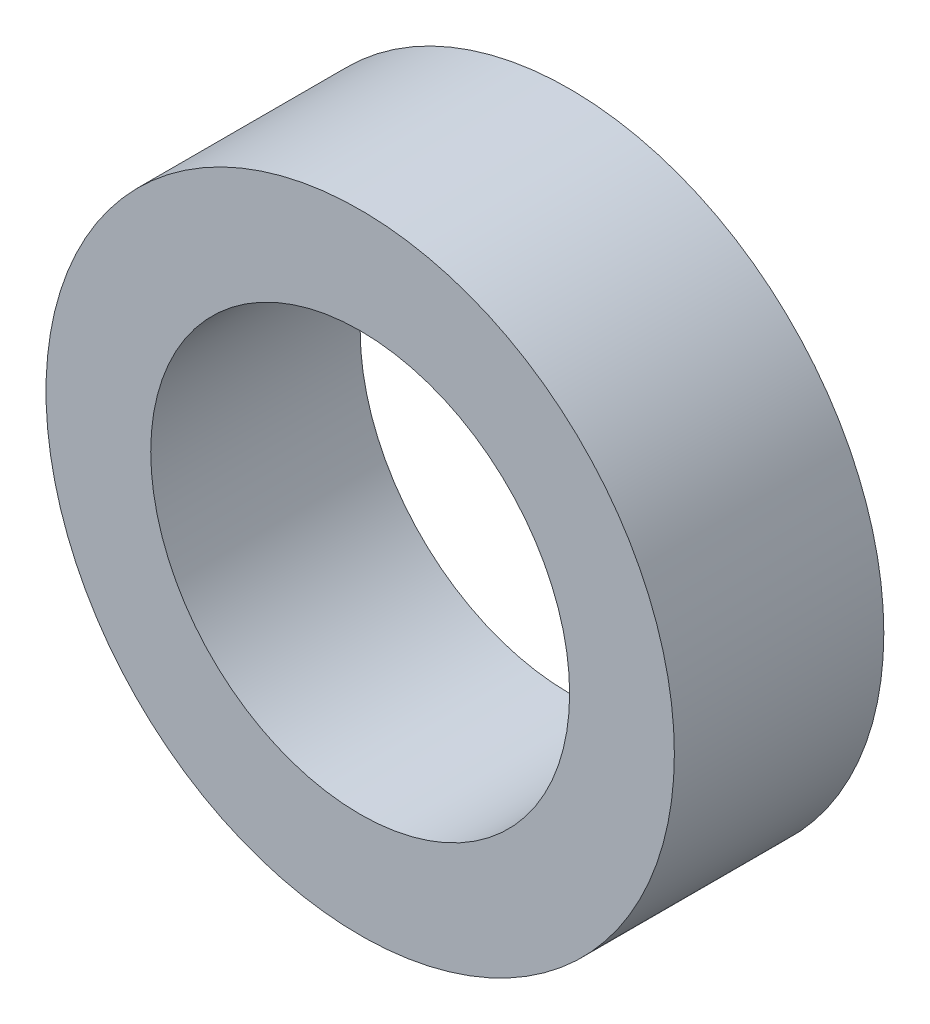
ISO-10303-21;
HEADER;
FILE_DESCRIPTION(('STEP AP214'),'2;1');
FILE_NAME('part.step','',(''),(''),'','','');
FILE_SCHEMA(('AUTOMOTIVE_DESIGN { 1 0 10303 214 1 1 1 1 }'));
ENDSEC;
DATA;
#1=APPLICATION_CONTEXT('core data for automotive mechanical design processes');
#2=APPLICATION_PROTOCOL_DEFINITION('international standard','automotive_design',2000,#1);
#3=PRODUCT_CONTEXT('',#1,'mechanical');
#4=PRODUCT('Part','Part','',(#3));
#5=PRODUCT_RELATED_PRODUCT_CATEGORY('part','',(#4));
#6=PRODUCT_DEFINITION_FORMATION('','',#4);
#7=PRODUCT_DEFINITION_CONTEXT('part definition',#1,'design');
#8=PRODUCT_DEFINITION('design','',#6,#7);
#9=PRODUCT_DEFINITION_SHAPE('','',#8);
#10=(LENGTH_UNIT() NAMED_UNIT(*) SI_UNIT(.MILLI.,.METRE.));
#11=(NAMED_UNIT(*) PLANE_ANGLE_UNIT() SI_UNIT($,.RADIAN.));
#12=(NAMED_UNIT(*) SI_UNIT($,.STERADIAN.) SOLID_ANGLE_UNIT());
#13=UNCERTAINTY_MEASURE_WITH_UNIT(LENGTH_MEASURE(1.E-05),#10,'distance_accuracy_value','');
#14=(GEOMETRIC_REPRESENTATION_CONTEXT(3) GLOBAL_UNCERTAINTY_ASSIGNED_CONTEXT((#13)) GLOBAL_UNIT_ASSIGNED_CONTEXT((#10,
#11,#12)) REPRESENTATION_CONTEXT('',''));
#15=CARTESIAN_POINT('',(0.,0.,0.));
#16=DIRECTION('',(0.,0.,1.));
#17=DIRECTION('',(1.,0.,0.));
#18=AXIS2_PLACEMENT_3D('',#15,#16,#17);
#19=CARTESIAN_POINT('',(0.,0.,5.));
#20=DIRECTION('',(0.,0.,1.));
#21=DIRECTION('',(1.,0.,0.));
#22=AXIS2_PLACEMENT_3D('',#19,#20,#21);
#23=PLANE('',#22);
#24=CARTESIAN_POINT('',(0.,0.,5.));
#25=DIRECTION('',(0.,0.,1.));
#26=DIRECTION('',(1.,0.,0.));
#27=AXIS2_PLACEMENT_3D('',#24,#25,#26);
#28=CIRCLE('',#27,7.5);
#29=CARTESIAN_POINT('',(7.5,0.,5.));
#30=VERTEX_POINT('',#29);
#31=EDGE_CURVE('E10',#30,#30,#28,.T.);
#32=ORIENTED_EDGE('',*,*,#31,.T.);
#33=EDGE_LOOP('',(#32));
#34=FACE_BOUND('',#33,.T.);
#35=CARTESIAN_POINT('',(0.,0.,5.));
#36=DIRECTION('',(0.,0.,1.));
#37=DIRECTION('',(1.,0.,0.));
#38=AXIS2_PLACEMENT_3D('',#35,#36,#37);
#39=CIRCLE('',#38,5.);
#40=CARTESIAN_POINT('',(5.,0.,5.));
#41=VERTEX_POINT('',#40);
#42=EDGE_CURVE('E50',#41,#41,#39,.T.);
#43=ORIENTED_EDGE('',*,*,#42,.F.);
#44=EDGE_LOOP('',(#43));
#45=FACE_BOUND('',#44,.T.);
#46=ADVANCED_FACE('F37',(#34,#45),#23,.T.);
#47=CARTESIAN_POINT('',(0.,0.,0.));
#48=DIRECTION('',(0.,0.,1.));
#49=DIRECTION('',(1.,0.,0.));
#50=AXIS2_PLACEMENT_3D('',#47,#48,#49);
#51=PLANE('',#50);
#52=CARTESIAN_POINT('',(0.,0.,0.));
#53=DIRECTION('',(0.,0.,1.));
#54=DIRECTION('',(1.,0.,0.));
#55=AXIS2_PLACEMENT_3D('',#52,#53,#54);
#56=CIRCLE('',#55,7.5);
#57=CARTESIAN_POINT('',(7.5,0.,0.));
#58=VERTEX_POINT('',#57);
#59=EDGE_CURVE('E41',#58,#58,#56,.T.);
#60=ORIENTED_EDGE('',*,*,#59,.F.);
#61=EDGE_LOOP('',(#60));
#62=FACE_BOUND('',#61,.T.);
#63=CARTESIAN_POINT('',(0.,0.,0.));
#64=DIRECTION('',(0.,0.,1.));
#65=DIRECTION('',(1.,0.,0.));
#66=AXIS2_PLACEMENT_3D('',#63,#64,#65);
#67=CIRCLE('',#66,5.);
#68=CARTESIAN_POINT('',(5.,0.,0.));
#69=VERTEX_POINT('',#68);
#70=EDGE_CURVE('E52',#69,#69,#67,.T.);
#71=ORIENTED_EDGE('',*,*,#70,.T.);
#72=EDGE_LOOP('',(#71));
#73=FACE_BOUND('',#72,.T.);
#74=ADVANCED_FACE('F64',(#62,#73),#51,.F.);
#75=CARTESIAN_POINT('',(0.,0.,5.));
#76=DIRECTION('',(0.,0.,-1.));
#77=DIRECTION('',(-1.,0.,0.));
#78=AXIS2_PLACEMENT_3D('',#75,#76,#77);
#79=CYLINDRICAL_SURFACE('',#78,7.5);
#80=ORIENTED_EDGE('',*,*,#31,.F.);
#81=EDGE_LOOP('',(#80));
#82=FACE_BOUND('',#81,.T.);
#83=ORIENTED_EDGE('',*,*,#59,.T.);
#84=EDGE_LOOP('',(#83));
#85=FACE_BOUND('',#84,.T.);
#86=ADVANCED_FACE('F39',(#82,#85),#79,.T.);
#87=CARTESIAN_POINT('',(0.,0.,5.));
#88=DIRECTION('',(0.,0.,-1.));
#89=DIRECTION('',(-1.,0.,0.));
#90=AXIS2_PLACEMENT_3D('',#87,#88,#89);
#91=CYLINDRICAL_SURFACE('',#90,5.);
#92=ORIENTED_EDGE('',*,*,#42,.T.);
#93=EDGE_LOOP('',(#92));
#94=FACE_BOUND('',#93,.T.);
#95=ORIENTED_EDGE('',*,*,#70,.F.);
#96=EDGE_LOOP('',(#95));
#97=FACE_BOUND('',#96,.T.);
#98=ADVANCED_FACE('F60',(#94,#97),#91,.F.);
#99=CLOSED_SHELL('',(#46,#74,#86,#98));
#100=MANIFOLD_SOLID_BREP('B2',#99);
#101=ADVANCED_BREP_SHAPE_REPRESENTATION('',(#18,#100),#14);
#102=SHAPE_DEFINITION_REPRESENTATION(#9,#101);
ENDSEC;
END-ISO-10303-21;
